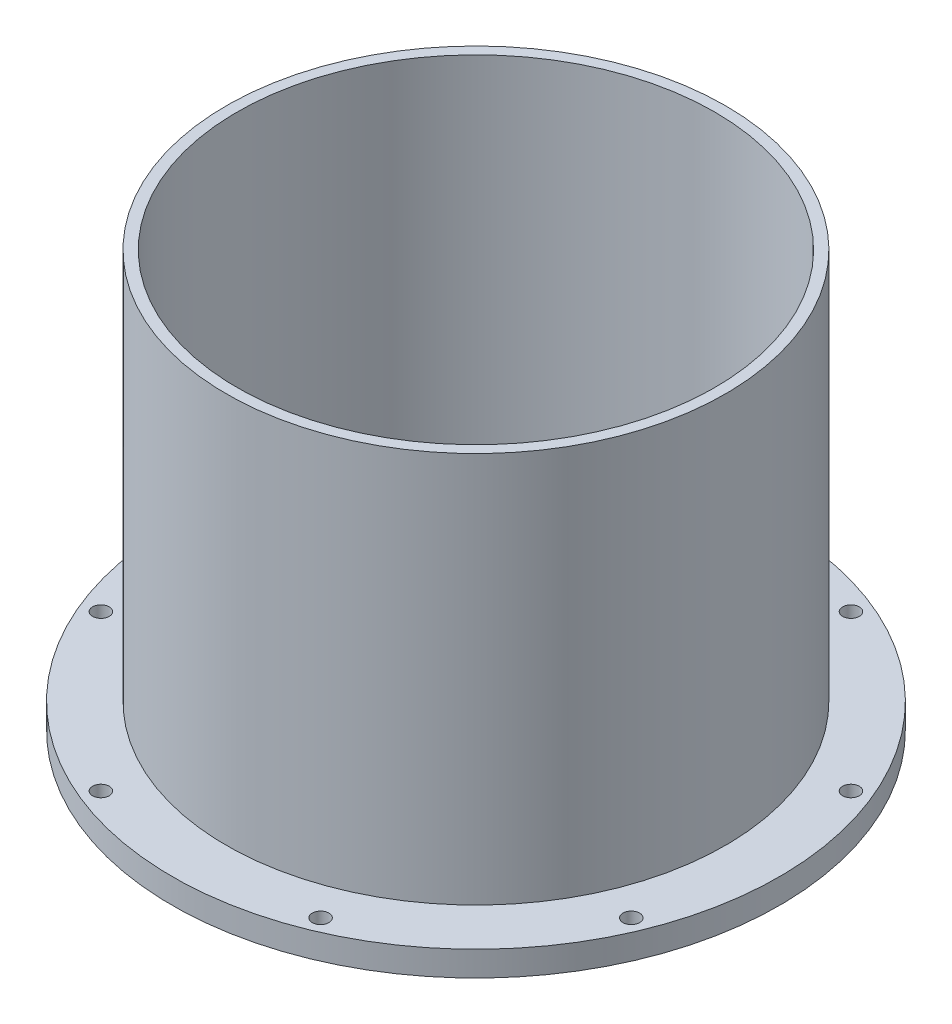
ISO-10303-21;
HEADER;
FILE_DESCRIPTION(('STEP AP214'),'2;1');
FILE_NAME('part.step','',(''),(''),'','','');
FILE_SCHEMA(('AUTOMOTIVE_DESIGN { 1 0 10303 214 1 1 1 1 }'));
ENDSEC;
DATA;
#1=APPLICATION_CONTEXT('core data for automotive mechanical design processes');
#2=APPLICATION_PROTOCOL_DEFINITION('international standard','automotive_design',2000,#1);
#3=PRODUCT_CONTEXT('',#1,'mechanical');
#4=PRODUCT('Part','Part','',(#3));
#5=PRODUCT_RELATED_PRODUCT_CATEGORY('part','',(#4));
#6=PRODUCT_DEFINITION_FORMATION('','',#4);
#7=PRODUCT_DEFINITION_CONTEXT('part definition',#1,'design');
#8=PRODUCT_DEFINITION('design','',#6,#7);
#9=PRODUCT_DEFINITION_SHAPE('','',#8);
#10=(LENGTH_UNIT() NAMED_UNIT(*) SI_UNIT(.MILLI.,.METRE.));
#11=(NAMED_UNIT(*) PLANE_ANGLE_UNIT() SI_UNIT($,.RADIAN.));
#12=(NAMED_UNIT(*) SI_UNIT($,.STERADIAN.) SOLID_ANGLE_UNIT());
#13=UNCERTAINTY_MEASURE_WITH_UNIT(LENGTH_MEASURE(1.E-05),#10,'distance_accuracy_value','');
#14=(GEOMETRIC_REPRESENTATION_CONTEXT(3) GLOBAL_UNCERTAINTY_ASSIGNED_CONTEXT((#13)) GLOBAL_UNIT_ASSIGNED_CONTEXT((#10,
#11,#12)) REPRESENTATION_CONTEXT('',''));
#15=CARTESIAN_POINT('',(0.,0.,0.));
#16=DIRECTION('',(0.,0.,1.));
#17=DIRECTION('',(1.,0.,0.));
#18=AXIS2_PLACEMENT_3D('',#15,#16,#17);
#19=CARTESIAN_POINT('',(-143.5,0.,0.));
#20=DIRECTION('',(0.,1.,0.));
#21=DIRECTION('',(0.,0.,1.));
#22=AXIS2_PLACEMENT_3D('',#19,#20,#21);
#23=PLANE('',#22);
#24=CARTESIAN_POINT('',(159.369219358198,0.,66.0128920829759));
#25=DIRECTION('',(0.,1.,0.));
#26=DIRECTION('',(-0.707106781186539,0.,0.707106781186556));
#27=AXIS2_PLACEMENT_3D('',#24,#25,#26);
#28=CIRCLE('',#27,4.99999999999999);
#29=CARTESIAN_POINT('',(155.833685452265,0.,69.5484259889087));
#30=VERTEX_POINT('',#29);
#31=EDGE_CURVE('E74',#30,#30,#28,.T.);
#32=ORIENTED_EDGE('',*,*,#31,.T.);
#33=EDGE_LOOP('',(#32));
#34=FACE_BOUND('',#33,.T.);
#35=CARTESIAN_POINT('',(66.0128920829798,0.,159.369219358196));
#36=DIRECTION('',(0.,1.,0.));
#37=DIRECTION('',(-1.,0.,0.));
#38=AXIS2_PLACEMENT_3D('',#35,#36,#37);
#39=CIRCLE('',#38,4.99999999999999);
#40=CARTESIAN_POINT('',(61.0128920829798,0.,159.369219358196));
#41=VERTEX_POINT('',#40);
#42=EDGE_CURVE('E80',#41,#41,#39,.T.);
#43=ORIENTED_EDGE('',*,*,#42,.T.);
#44=EDGE_LOOP('',(#43));
#45=FACE_BOUND('',#44,.T.);
#46=CARTESIAN_POINT('',(-66.0128920829764,0.,159.369219358198));
#47=DIRECTION('',(0.,1.,0.));
#48=DIRECTION('',(-0.707106781186554,0.,-0.707106781186541));
#49=AXIS2_PLACEMENT_3D('',#46,#47,#48);
#50=CIRCLE('',#49,4.99999999999999);
#51=CARTESIAN_POINT('',(-69.5484259889092,0.,155.833685452265));
#52=VERTEX_POINT('',#51);
#53=EDGE_CURVE('E86',#52,#52,#50,.T.);
#54=ORIENTED_EDGE('',*,*,#53,.T.);
#55=EDGE_LOOP('',(#54));
#56=FACE_BOUND('',#55,.T.);
#57=CARTESIAN_POINT('',(-159.369219358197,0.,66.0128920829781));
#58=DIRECTION('',(0.,1.,0.));
#59=DIRECTION('',(0.,0.,-1.));
#60=AXIS2_PLACEMENT_3D('',#57,#58,#59);
#61=CIRCLE('',#60,4.99999999999999);
#62=CARTESIAN_POINT('',(-159.369219358197,0.,61.0128920829781));
#63=VERTEX_POINT('',#62);
#64=EDGE_CURVE('E92',#63,#63,#61,.T.);
#65=ORIENTED_EDGE('',*,*,#64,.T.);
#66=EDGE_LOOP('',(#65));
#67=FACE_BOUND('',#66,.T.);
#68=CARTESIAN_POINT('',(-159.369219358197,0.,-66.012892082977));
#69=DIRECTION('',(0.,1.,0.));
#70=DIRECTION('',(0.707106781186544,0.,-0.707106781186551));
#71=AXIS2_PLACEMENT_3D('',#68,#69,#70);
#72=CIRCLE('',#71,4.99999999999999);
#73=CARTESIAN_POINT('',(-155.833685452265,0.,-69.5484259889098));
#74=VERTEX_POINT('',#73);
#75=EDGE_CURVE('E98',#74,#74,#72,.T.);
#76=ORIENTED_EDGE('',*,*,#75,.T.);
#77=EDGE_LOOP('',(#76));
#78=FACE_BOUND('',#77,.T.);
#79=CARTESIAN_POINT('',(-66.0128920829787,0.,-159.369219358197));
#80=DIRECTION('',(0.,1.,0.));
#81=DIRECTION('',(1.,0.,0.));
#82=AXIS2_PLACEMENT_3D('',#79,#80,#81);
#83=CIRCLE('',#82,4.99999999999999);
#84=CARTESIAN_POINT('',(-61.0128920829787,0.,-159.369219358197));
#85=VERTEX_POINT('',#84);
#86=EDGE_CURVE('E68',#85,#85,#83,.T.);
#87=ORIENTED_EDGE('',*,*,#86,.T.);
#88=EDGE_LOOP('',(#87));
#89=FACE_BOUND('',#88,.T.);
#90=CARTESIAN_POINT('',(66.0128920829776,0.,-159.369219358197));
#91=DIRECTION('',(0.,1.,0.));
#92=DIRECTION('',(0.707106781186549,0.,0.707106781186546));
#93=AXIS2_PLACEMENT_3D('',#90,#91,#92);
#94=CIRCLE('',#93,4.99999999999999);
#95=CARTESIAN_POINT('',(69.5484259889103,0.,-155.833685452264));
#96=VERTEX_POINT('',#95);
#97=EDGE_CURVE('E62',#96,#96,#94,.T.);
#98=ORIENTED_EDGE('',*,*,#97,.T.);
#99=EDGE_LOOP('',(#98));
#100=FACE_BOUND('',#99,.T.);
#101=CARTESIAN_POINT('',(159.369219358197,0.,-66.0128920829781));
#102=DIRECTION('',(0.,1.,0.));
#103=DIRECTION('',(0.,0.,1.));
#104=AXIS2_PLACEMENT_3D('',#101,#102,#103);
#105=CIRCLE('',#104,4.99999999999999);
#106=CARTESIAN_POINT('',(159.369219358197,0.,-61.0128920829781));
#107=VERTEX_POINT('',#106);
#108=EDGE_CURVE('E58',#107,#107,#105,.T.);
#109=ORIENTED_EDGE('',*,*,#108,.T.);
#110=EDGE_LOOP('',(#109));
#111=FACE_BOUND('',#110,.T.);
#112=CARTESIAN_POINT('',(0.,0.,0.));
#113=DIRECTION('',(0.,-1.,0.));
#114=DIRECTION('',(0.,0.,-1.));
#115=AXIS2_PLACEMENT_3D('',#112,#113,#114);
#116=CIRCLE('',#115,143.5);
#117=CARTESIAN_POINT('',(0.,0.,-143.5));
#118=VERTEX_POINT('',#117);
#119=EDGE_CURVE('E55',#118,#118,#116,.T.);
#120=ORIENTED_EDGE('',*,*,#119,.F.);
#121=EDGE_LOOP('',(#120));
#122=FACE_BOUND('',#121,.T.);
#123=CARTESIAN_POINT('',(0.,0.,0.));
#124=DIRECTION('',(0.,-1.,0.));
#125=DIRECTION('',(0.,0.,-1.));
#126=AXIS2_PLACEMENT_3D('',#123,#124,#125);
#127=CIRCLE('',#126,182.5);
#128=CARTESIAN_POINT('',(0.,0.,-182.5));
#129=VERTEX_POINT('',#128);
#130=EDGE_CURVE('E10',#129,#129,#127,.T.);
#131=ORIENTED_EDGE('',*,*,#130,.T.);
#132=EDGE_LOOP('',(#131));
#133=FACE_BOUND('',#132,.T.);
#134=ADVANCED_FACE('F33',(#34,#45,#56,#67,#78,#89,#100,#111,#122,#133),#23,.F.);
#135=CARTESIAN_POINT('',(0.,0.,0.));
#136=DIRECTION('',(0.,-1.,0.));
#137=DIRECTION('',(0.,0.,-1.));
#138=AXIS2_PLACEMENT_3D('',#135,#136,#137);
#139=CYLINDRICAL_SURFACE('',#138,182.5);
#140=ORIENTED_EDGE('',*,*,#130,.F.);
#141=EDGE_LOOP('',(#140));
#142=FACE_BOUND('',#141,.T.);
#143=CARTESIAN_POINT('',(0.,15.,0.));
#144=DIRECTION('',(0.,-1.,0.));
#145=DIRECTION('',(0.,0.,-1.));
#146=AXIS2_PLACEMENT_3D('',#143,#144,#145);
#147=CIRCLE('',#146,182.5);
#148=CARTESIAN_POINT('',(0.,15.,-182.5));
#149=VERTEX_POINT('',#148);
#150=EDGE_CURVE('E39',#149,#149,#147,.T.);
#151=ORIENTED_EDGE('',*,*,#150,.T.);
#152=EDGE_LOOP('',(#151));
#153=FACE_BOUND('',#152,.T.);
#154=ADVANCED_FACE('F121',(#142,#153),#139,.T.);
#155=CARTESIAN_POINT('',(-150.,15.,0.));
#156=DIRECTION('',(0.,-1.,0.));
#157=DIRECTION('',(0.,0.,-1.));
#158=AXIS2_PLACEMENT_3D('',#155,#156,#157);
#159=PLANE('',#158);
#160=CARTESIAN_POINT('',(159.369219358198,15.,66.0128920829759));
#161=DIRECTION('',(0.,-1.,0.));
#162=DIRECTION('',(0.,0.,-1.));
#163=AXIS2_PLACEMENT_3D('',#160,#161,#162);
#164=CIRCLE('',#163,4.99999999999999);
#165=CARTESIAN_POINT('',(159.369219358198,15.,61.0128920829759));
#166=VERTEX_POINT('',#165);
#167=EDGE_CURVE('E71',#166,#166,#164,.T.);
#168=ORIENTED_EDGE('',*,*,#167,.T.);
#169=EDGE_LOOP('',(#168));
#170=FACE_BOUND('',#169,.T.);
#171=CARTESIAN_POINT('',(66.0128920829798,15.,159.369219358196));
#172=DIRECTION('',(0.,-1.,0.));
#173=DIRECTION('',(0.,0.,-1.));
#174=AXIS2_PLACEMENT_3D('',#171,#172,#173);
#175=CIRCLE('',#174,4.99999999999999);
#176=CARTESIAN_POINT('',(66.0128920829798,15.,154.369219358196));
#177=VERTEX_POINT('',#176);
#178=EDGE_CURVE('E77',#177,#177,#175,.T.);
#179=ORIENTED_EDGE('',*,*,#178,.T.);
#180=EDGE_LOOP('',(#179));
#181=FACE_BOUND('',#180,.T.);
#182=CARTESIAN_POINT('',(-66.0128920829764,15.,159.369219358198));
#183=DIRECTION('',(0.,-1.,0.));
#184=DIRECTION('',(0.,0.,-1.));
#185=AXIS2_PLACEMENT_3D('',#182,#183,#184);
#186=CIRCLE('',#185,4.99999999999999);
#187=CARTESIAN_POINT('',(-66.0128920829764,15.,154.369219358198));
#188=VERTEX_POINT('',#187);
#189=EDGE_CURVE('E83',#188,#188,#186,.T.);
#190=ORIENTED_EDGE('',*,*,#189,.T.);
#191=EDGE_LOOP('',(#190));
#192=FACE_BOUND('',#191,.T.);
#193=CARTESIAN_POINT('',(-159.369219358197,15.,66.0128920829781));
#194=DIRECTION('',(0.,-1.,0.));
#195=DIRECTION('',(0.,0.,-1.));
#196=AXIS2_PLACEMENT_3D('',#193,#194,#195);
#197=CIRCLE('',#196,4.99999999999999);
#198=CARTESIAN_POINT('',(-159.369219358197,15.,61.0128920829781));
#199=VERTEX_POINT('',#198);
#200=EDGE_CURVE('E89',#199,#199,#197,.T.);
#201=ORIENTED_EDGE('',*,*,#200,.T.);
#202=EDGE_LOOP('',(#201));
#203=FACE_BOUND('',#202,.T.);
#204=CARTESIAN_POINT('',(-159.369219358197,15.,-66.012892082977));
#205=DIRECTION('',(0.,-1.,0.));
#206=DIRECTION('',(0.,0.,-1.));
#207=AXIS2_PLACEMENT_3D('',#204,#205,#206);
#208=CIRCLE('',#207,4.99999999999999);
#209=CARTESIAN_POINT('',(-159.369219358197,15.,-71.012892082977));
#210=VERTEX_POINT('',#209);
#211=EDGE_CURVE('E95',#210,#210,#208,.T.);
#212=ORIENTED_EDGE('',*,*,#211,.T.);
#213=EDGE_LOOP('',(#212));
#214=FACE_BOUND('',#213,.T.);
#215=CARTESIAN_POINT('',(-66.0128920829787,15.,-159.369219358197));
#216=DIRECTION('',(0.,-1.,0.));
#217=DIRECTION('',(0.,0.,-1.));
#218=AXIS2_PLACEMENT_3D('',#215,#216,#217);
#219=CIRCLE('',#218,4.99999999999999);
#220=CARTESIAN_POINT('',(-66.0128920829787,15.,-164.369219358197));
#221=VERTEX_POINT('',#220);
#222=EDGE_CURVE('E101',#221,#221,#219,.T.);
#223=ORIENTED_EDGE('',*,*,#222,.T.);
#224=EDGE_LOOP('',(#223));
#225=FACE_BOUND('',#224,.T.);
#226=CARTESIAN_POINT('',(66.0128920829776,15.,-159.369219358197));
#227=DIRECTION('',(0.,-1.,0.));
#228=DIRECTION('',(0.,0.,-1.));
#229=AXIS2_PLACEMENT_3D('',#226,#227,#228);
#230=CIRCLE('',#229,4.99999999999999);
#231=CARTESIAN_POINT('',(66.0128920829776,15.,-164.369219358197));
#232=VERTEX_POINT('',#231);
#233=EDGE_CURVE('E65',#232,#232,#230,.T.);
#234=ORIENTED_EDGE('',*,*,#233,.T.);
#235=EDGE_LOOP('',(#234));
#236=FACE_BOUND('',#235,.T.);
#237=CARTESIAN_POINT('',(159.369219358197,15.,-66.0128920829781));
#238=DIRECTION('',(0.,-1.,0.));
#239=DIRECTION('',(0.,0.,-1.));
#240=AXIS2_PLACEMENT_3D('',#237,#238,#239);
#241=CIRCLE('',#240,4.99999999999999);
#242=CARTESIAN_POINT('',(159.369219358197,15.,-71.0128920829781));
#243=VERTEX_POINT('',#242);
#244=EDGE_CURVE('E59',#243,#243,#241,.T.);
#245=ORIENTED_EDGE('',*,*,#244,.T.);
#246=EDGE_LOOP('',(#245));
#247=FACE_BOUND('',#246,.T.);
#248=ORIENTED_EDGE('',*,*,#150,.F.);
#249=EDGE_LOOP('',(#248));
#250=FACE_BOUND('',#249,.T.);
#251=CARTESIAN_POINT('',(0.,15.,0.));
#252=DIRECTION('',(0.,-1.,0.));
#253=DIRECTION('',(0.,0.,-1.));
#254=AXIS2_PLACEMENT_3D('',#251,#252,#253);
#255=CIRCLE('',#254,150.);
#256=CARTESIAN_POINT('',(0.,15.,-150.));
#257=VERTEX_POINT('',#256);
#258=EDGE_CURVE('E43',#257,#257,#255,.T.);
#259=ORIENTED_EDGE('',*,*,#258,.T.);
#260=EDGE_LOOP('',(#259));
#261=FACE_BOUND('',#260,.T.);
#262=ADVANCED_FACE('F117',(#170,#181,#192,#203,#214,#225,#236,#247,#250,#261),#159,.F.);
#263=CARTESIAN_POINT('',(0.,0.,0.));
#264=DIRECTION('',(0.,-1.,0.));
#265=DIRECTION('',(0.,0.,-1.));
#266=AXIS2_PLACEMENT_3D('',#263,#264,#265);
#267=CYLINDRICAL_SURFACE('',#266,150.);
#268=ORIENTED_EDGE('',*,*,#258,.F.);
#269=EDGE_LOOP('',(#268));
#270=FACE_BOUND('',#269,.T.);
#271=CARTESIAN_POINT('',(0.,250.,0.));
#272=DIRECTION('',(0.,-1.,0.));
#273=DIRECTION('',(0.,0.,-1.));
#274=AXIS2_PLACEMENT_3D('',#271,#272,#273);
#275=CIRCLE('',#274,150.);
#276=CARTESIAN_POINT('',(0.,250.,-150.));
#277=VERTEX_POINT('',#276);
#278=EDGE_CURVE('E47',#277,#277,#275,.T.);
#279=ORIENTED_EDGE('',*,*,#278,.T.);
#280=EDGE_LOOP('',(#279));
#281=FACE_BOUND('',#280,.T.);
#282=ADVANCED_FACE('F120',(#270,#281),#267,.T.);
#283=CARTESIAN_POINT('',(-150.,250.,0.));
#284=DIRECTION('',(0.,-1.,0.));
#285=DIRECTION('',(0.,0.,-1.));
#286=AXIS2_PLACEMENT_3D('',#283,#284,#285);
#287=PLANE('',#286);
#288=ORIENTED_EDGE('',*,*,#278,.F.);
#289=EDGE_LOOP('',(#288));
#290=FACE_BOUND('',#289,.T.);
#291=CARTESIAN_POINT('',(0.,250.,0.));
#292=DIRECTION('',(0.,-1.,0.));
#293=DIRECTION('',(0.,0.,-1.));
#294=AXIS2_PLACEMENT_3D('',#291,#292,#293);
#295=CIRCLE('',#294,143.5);
#296=CARTESIAN_POINT('',(0.,250.,-143.5));
#297=VERTEX_POINT('',#296);
#298=EDGE_CURVE('E52',#297,#297,#295,.T.);
#299=ORIENTED_EDGE('',*,*,#298,.T.);
#300=EDGE_LOOP('',(#299));
#301=FACE_BOUND('',#300,.T.);
#302=ADVANCED_FACE('F133',(#290,#301),#287,.F.);
#303=CARTESIAN_POINT('',(0.,0.,0.));
#304=DIRECTION('',(0.,-1.,0.));
#305=DIRECTION('',(0.,0.,-1.));
#306=AXIS2_PLACEMENT_3D('',#303,#304,#305);
#307=CYLINDRICAL_SURFACE('',#306,143.5);
#308=ORIENTED_EDGE('',*,*,#298,.F.);
#309=EDGE_LOOP('',(#308));
#310=FACE_BOUND('',#309,.T.);
#311=ORIENTED_EDGE('',*,*,#119,.T.);
#312=EDGE_LOOP('',(#311));
#313=FACE_BOUND('',#312,.T.);
#314=ADVANCED_FACE('F139',(#310,#313),#307,.F.);
#315=CARTESIAN_POINT('',(159.369219358197,250.001,-66.0128920829781));
#316=DIRECTION('',(0.,-1.,0.));
#317=DIRECTION('',(0.,0.,-1.));
#318=AXIS2_PLACEMENT_3D('',#315,#316,#317);
#319=CYLINDRICAL_SURFACE('',#318,4.99999999999999);
#320=ORIENTED_EDGE('',*,*,#108,.F.);
#321=EDGE_LOOP('',(#320));
#322=FACE_BOUND('',#321,.T.);
#323=ORIENTED_EDGE('',*,*,#244,.F.);
#324=EDGE_LOOP('',(#323));
#325=FACE_BOUND('',#324,.T.);
#326=ADVANCED_FACE('F145',(#322,#325),#319,.F.);
#327=CARTESIAN_POINT('',(66.0128920829776,250.001,-159.369219358197));
#328=DIRECTION('',(0.,-1.,0.));
#329=DIRECTION('',(0.,0.,-1.));
#330=AXIS2_PLACEMENT_3D('',#327,#328,#329);
#331=CYLINDRICAL_SURFACE('',#330,4.99999999999999);
#332=ORIENTED_EDGE('',*,*,#97,.F.);
#333=EDGE_LOOP('',(#332));
#334=FACE_BOUND('',#333,.T.);
#335=ORIENTED_EDGE('',*,*,#233,.F.);
#336=EDGE_LOOP('',(#335));
#337=FACE_BOUND('',#336,.T.);
#338=ADVANCED_FACE('F113',(#334,#337),#331,.F.);
#339=CARTESIAN_POINT('',(-66.0128920829787,250.001,-159.369219358197));
#340=DIRECTION('',(0.,-1.,0.));
#341=DIRECTION('',(0.,0.,-1.));
#342=AXIS2_PLACEMENT_3D('',#339,#340,#341);
#343=CYLINDRICAL_SURFACE('',#342,4.99999999999999);
#344=ORIENTED_EDGE('',*,*,#86,.F.);
#345=EDGE_LOOP('',(#344));
#346=FACE_BOUND('',#345,.T.);
#347=ORIENTED_EDGE('',*,*,#222,.F.);
#348=EDGE_LOOP('',(#347));
#349=FACE_BOUND('',#348,.T.);
#350=ADVANCED_FACE('F109',(#346,#349),#343,.F.);
#351=CARTESIAN_POINT('',(-159.369219358197,250.001,-66.012892082977));
#352=DIRECTION('',(0.,-1.,0.));
#353=DIRECTION('',(0.,0.,-1.));
#354=AXIS2_PLACEMENT_3D('',#351,#352,#353);
#355=CYLINDRICAL_SURFACE('',#354,4.99999999999999);
#356=ORIENTED_EDGE('',*,*,#75,.F.);
#357=EDGE_LOOP('',(#356));
#358=FACE_BOUND('',#357,.T.);
#359=ORIENTED_EDGE('',*,*,#211,.F.);
#360=EDGE_LOOP('',(#359));
#361=FACE_BOUND('',#360,.T.);
#362=ADVANCED_FACE('F112',(#358,#361),#355,.F.);
#363=CARTESIAN_POINT('',(-159.369219358197,250.001,66.0128920829781));
#364=DIRECTION('',(0.,-1.,0.));
#365=DIRECTION('',(0.,0.,-1.));
#366=AXIS2_PLACEMENT_3D('',#363,#364,#365);
#367=CYLINDRICAL_SURFACE('',#366,4.99999999999999);
#368=ORIENTED_EDGE('',*,*,#64,.F.);
#369=EDGE_LOOP('',(#368));
#370=FACE_BOUND('',#369,.T.);
#371=ORIENTED_EDGE('',*,*,#200,.F.);
#372=EDGE_LOOP('',(#371));
#373=FACE_BOUND('',#372,.T.);
#374=ADVANCED_FACE('F167',(#370,#373),#367,.F.);
#375=CARTESIAN_POINT('',(-66.0128920829764,250.001,159.369219358198));
#376=DIRECTION('',(0.,-1.,0.));
#377=DIRECTION('',(0.,0.,-1.));
#378=AXIS2_PLACEMENT_3D('',#375,#376,#377);
#379=CYLINDRICAL_SURFACE('',#378,4.99999999999999);
#380=ORIENTED_EDGE('',*,*,#53,.F.);
#381=EDGE_LOOP('',(#380));
#382=FACE_BOUND('',#381,.T.);
#383=ORIENTED_EDGE('',*,*,#189,.F.);
#384=EDGE_LOOP('',(#383));
#385=FACE_BOUND('',#384,.T.);
#386=ADVANCED_FACE('F174',(#382,#385),#379,.F.);
#387=CARTESIAN_POINT('',(66.0128920829798,250.001,159.369219358196));
#388=DIRECTION('',(0.,-1.,0.));
#389=DIRECTION('',(0.,0.,-1.));
#390=AXIS2_PLACEMENT_3D('',#387,#388,#389);
#391=CYLINDRICAL_SURFACE('',#390,4.99999999999999);
#392=ORIENTED_EDGE('',*,*,#42,.F.);
#393=EDGE_LOOP('',(#392));
#394=FACE_BOUND('',#393,.T.);
#395=ORIENTED_EDGE('',*,*,#178,.F.);
#396=EDGE_LOOP('',(#395));
#397=FACE_BOUND('',#396,.T.);
#398=ADVANCED_FACE('F180',(#394,#397),#391,.F.);
#399=CARTESIAN_POINT('',(159.369219358198,250.001,66.0128920829759));
#400=DIRECTION('',(0.,-1.,0.));
#401=DIRECTION('',(0.,0.,-1.));
#402=AXIS2_PLACEMENT_3D('',#399,#400,#401);
#403=CYLINDRICAL_SURFACE('',#402,4.99999999999999);
#404=ORIENTED_EDGE('',*,*,#31,.F.);
#405=EDGE_LOOP('',(#404));
#406=FACE_BOUND('',#405,.T.);
#407=ORIENTED_EDGE('',*,*,#167,.F.);
#408=EDGE_LOOP('',(#407));
#409=FACE_BOUND('',#408,.T.);
#410=ADVANCED_FACE('F184',(#406,#409),#403,.F.);
#411=CLOSED_SHELL('',(#134,#154,#262,#282,#302,#314,#326,#338,#350,#362,#374,#386,#398,#410));
#412=MANIFOLD_SOLID_BREP('B2',#411);
#413=ADVANCED_BREP_SHAPE_REPRESENTATION('',(#18,#412),#14);
#414=SHAPE_DEFINITION_REPRESENTATION(#9,#413);
ENDSEC;
END-ISO-10303-21;
